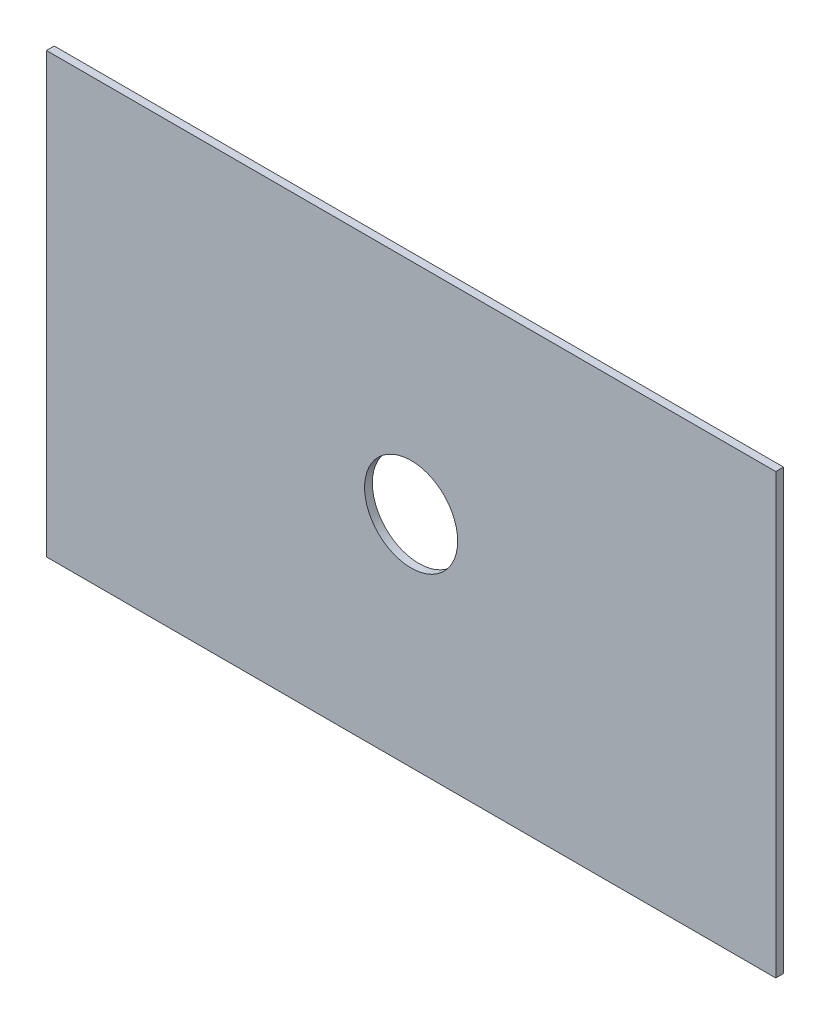
ISO-10303-21;
HEADER;
FILE_DESCRIPTION(('STEP AP214'),'2;1');
FILE_NAME('part.step','',(''),(''),'','','');
FILE_SCHEMA(('AUTOMOTIVE_DESIGN { 1 0 10303 214 1 1 1 1 }'));
ENDSEC;
DATA;
#1=APPLICATION_CONTEXT('core data for automotive mechanical design processes');
#2=APPLICATION_PROTOCOL_DEFINITION('international standard','automotive_design',2000,#1);
#3=PRODUCT_CONTEXT('',#1,'mechanical');
#4=PRODUCT('Part','Part','',(#3));
#5=PRODUCT_RELATED_PRODUCT_CATEGORY('part','',(#4));
#6=PRODUCT_DEFINITION_FORMATION('','',#4);
#7=PRODUCT_DEFINITION_CONTEXT('part definition',#1,'design');
#8=PRODUCT_DEFINITION('design','',#6,#7);
#9=PRODUCT_DEFINITION_SHAPE('','',#8);
#10=(LENGTH_UNIT() NAMED_UNIT(*) SI_UNIT(.MILLI.,.METRE.));
#11=(NAMED_UNIT(*) PLANE_ANGLE_UNIT() SI_UNIT($,.RADIAN.));
#12=(NAMED_UNIT(*) SI_UNIT($,.STERADIAN.) SOLID_ANGLE_UNIT());
#13=UNCERTAINTY_MEASURE_WITH_UNIT(LENGTH_MEASURE(1.E-05),#10,'distance_accuracy_value','');
#14=(GEOMETRIC_REPRESENTATION_CONTEXT(3) GLOBAL_UNCERTAINTY_ASSIGNED_CONTEXT((#13)) GLOBAL_UNIT_ASSIGNED_CONTEXT((#10,
#11,#12)) REPRESENTATION_CONTEXT('',''));
#15=CARTESIAN_POINT('',(0.,0.,0.));
#16=DIRECTION('',(0.,0.,1.));
#17=DIRECTION('',(1.,0.,0.));
#18=AXIS2_PLACEMENT_3D('',#15,#16,#17);
#19=CARTESIAN_POINT('',(23.5001496169545,-14.1332099633575,0.5));
#20=DIRECTION('',(-1.,0.,0.));
#21=DIRECTION('',(0.,0.,1.));
#22=AXIS2_PLACEMENT_3D('',#19,#20,#21);
#23=PLANE('',#22);
#24=DIRECTION('',(0.,1.,0.));
#25=VECTOR('',#24,1.);
#26=CARTESIAN_POINT('',(23.5001496169545,-14.1332099633575,0.));
#27=LINE('',#26,#25);
#28=CARTESIAN_POINT('',(23.5001496169545,-14.1332099633575,0.));
#29=VERTEX_POINT('',#28);
#30=CARTESIAN_POINT('',(23.5001496169545,14.1332099633575,0.));
#31=VERTEX_POINT('',#30);
#32=EDGE_CURVE('E99',#29,#31,#27,.T.);
#33=ORIENTED_EDGE('',*,*,#32,.T.);
#34=DIRECTION('',(0.,0.,-1.));
#35=VECTOR('',#34,1.);
#36=CARTESIAN_POINT('',(23.5001496169545,14.1332099633575,0.5));
#37=LINE('',#36,#35);
#38=CARTESIAN_POINT('',(23.5001496169545,14.1332099633575,0.5));
#39=VERTEX_POINT('',#38);
#40=EDGE_CURVE('E11',#39,#31,#37,.T.);
#41=ORIENTED_EDGE('',*,*,#40,.F.);
#42=DIRECTION('',(0.,1.,0.));
#43=VECTOR('',#42,1.);
#44=CARTESIAN_POINT('',(23.5001496169545,-14.1332099633575,0.5));
#45=LINE('',#44,#43);
#46=CARTESIAN_POINT('',(23.5001496169545,-14.1332099633575,0.5));
#47=VERTEX_POINT('',#46);
#48=EDGE_CURVE('E86',#47,#39,#45,.T.);
#49=ORIENTED_EDGE('',*,*,#48,.F.);
#50=DIRECTION('',(0.,0.,-1.));
#51=VECTOR('',#50,1.);
#52=CARTESIAN_POINT('',(23.5001496169545,-14.1332099633575,0.5));
#53=LINE('',#52,#51);
#54=EDGE_CURVE('E95',#47,#29,#53,.T.);
#55=ORIENTED_EDGE('',*,*,#54,.T.);
#56=EDGE_LOOP('',(#33,#41,#49,#55));
#57=FACE_BOUND('',#56,.T.);
#58=ADVANCED_FACE('F34',(#57),#23,.F.);
#59=CARTESIAN_POINT('',(-23.5001496169545,14.1332099633575,0.5));
#60=DIRECTION('',(0.,-1.,0.));
#61=DIRECTION('',(0.,0.,-1.));
#62=AXIS2_PLACEMENT_3D('',#59,#60,#61);
#63=PLANE('',#62);
#64=DIRECTION('',(-1.,0.,0.));
#65=VECTOR('',#64,1.);
#66=CARTESIAN_POINT('',(-23.5001496169545,14.1332099633575,0.));
#67=LINE('',#66,#65);
#68=CARTESIAN_POINT('',(-23.5001496169545,14.1332099633575,0.));
#69=VERTEX_POINT('',#68);
#70=EDGE_CURVE('E90',#31,#69,#67,.T.);
#71=ORIENTED_EDGE('',*,*,#70,.T.);
#72=DIRECTION('',(0.,0.,-1.));
#73=VECTOR('',#72,1.);
#74=CARTESIAN_POINT('',(-23.5001496169545,14.1332099633575,0.5));
#75=LINE('',#74,#73);
#76=CARTESIAN_POINT('',(-23.5001496169545,14.1332099633575,0.5));
#77=VERTEX_POINT('',#76);
#78=EDGE_CURVE('E43',#77,#69,#75,.T.);
#79=ORIENTED_EDGE('',*,*,#78,.F.);
#80=DIRECTION('',(-1.,0.,0.));
#81=VECTOR('',#80,1.);
#82=CARTESIAN_POINT('',(-23.5001496169545,14.1332099633575,0.5));
#83=LINE('',#82,#81);
#84=EDGE_CURVE('E81',#39,#77,#83,.T.);
#85=ORIENTED_EDGE('',*,*,#84,.F.);
#86=ORIENTED_EDGE('',*,*,#40,.T.);
#87=EDGE_LOOP('',(#71,#79,#85,#86));
#88=FACE_BOUND('',#87,.T.);
#89=ADVANCED_FACE('F89',(#88),#63,.F.);
#90=CARTESIAN_POINT('',(-23.5001496169545,-14.1332099633575,0.5));
#91=DIRECTION('',(1.,0.,0.));
#92=DIRECTION('',(0.,0.,-1.));
#93=AXIS2_PLACEMENT_3D('',#90,#91,#92);
#94=PLANE('',#93);
#95=DIRECTION('',(0.,-1.,0.));
#96=VECTOR('',#95,1.);
#97=CARTESIAN_POINT('',(-23.5001496169545,-14.1332099633575,0.));
#98=LINE('',#97,#96);
#99=CARTESIAN_POINT('',(-23.5001496169545,-14.1332099633575,0.));
#100=VERTEX_POINT('',#99);
#101=EDGE_CURVE('E68',#69,#100,#98,.T.);
#102=ORIENTED_EDGE('',*,*,#101,.T.);
#103=DIRECTION('',(0.,0.,-1.));
#104=VECTOR('',#103,1.);
#105=CARTESIAN_POINT('',(-23.5001496169545,-14.1332099633575,0.5));
#106=LINE('',#105,#104);
#107=CARTESIAN_POINT('',(-23.5001496169545,-14.1332099633575,0.5));
#108=VERTEX_POINT('',#107);
#109=EDGE_CURVE('E91',#108,#100,#106,.T.);
#110=ORIENTED_EDGE('',*,*,#109,.F.);
#111=DIRECTION('',(0.,-1.,0.));
#112=VECTOR('',#111,1.);
#113=CARTESIAN_POINT('',(-23.5001496169545,-14.1332099633575,0.5));
#114=LINE('',#113,#112);
#115=EDGE_CURVE('E84',#77,#108,#114,.T.);
#116=ORIENTED_EDGE('',*,*,#115,.F.);
#117=ORIENTED_EDGE('',*,*,#78,.T.);
#118=EDGE_LOOP('',(#102,#110,#116,#117));
#119=FACE_BOUND('',#118,.T.);
#120=ADVANCED_FACE('F93',(#119),#94,.F.);
#121=CARTESIAN_POINT('',(-23.5001496169545,-14.1332099633575,0.5));
#122=DIRECTION('',(0.,1.,0.));
#123=DIRECTION('',(0.,0.,1.));
#124=AXIS2_PLACEMENT_3D('',#121,#122,#123);
#125=PLANE('',#124);
#126=DIRECTION('',(1.,0.,0.));
#127=VECTOR('',#126,1.);
#128=CARTESIAN_POINT('',(-23.5001496169545,-14.1332099633575,0.));
#129=LINE('',#128,#127);
#130=EDGE_CURVE('E74',#100,#29,#129,.T.);
#131=ORIENTED_EDGE('',*,*,#130,.T.);
#132=ORIENTED_EDGE('',*,*,#54,.F.);
#133=DIRECTION('',(1.,0.,0.));
#134=VECTOR('',#133,1.);
#135=CARTESIAN_POINT('',(-23.5001496169545,-14.1332099633575,0.5));
#136=LINE('',#135,#134);
#137=EDGE_CURVE('E51',#108,#47,#136,.T.);
#138=ORIENTED_EDGE('',*,*,#137,.F.);
#139=ORIENTED_EDGE('',*,*,#109,.T.);
#140=EDGE_LOOP('',(#131,#132,#138,#139));
#141=FACE_BOUND('',#140,.T.);
#142=ADVANCED_FACE('F106',(#141),#125,.F.);
#143=CARTESIAN_POINT('',(0.,0.,0.5));
#144=DIRECTION('',(0.,0.,-1.));
#145=DIRECTION('',(-1.,0.,0.));
#146=AXIS2_PLACEMENT_3D('',#143,#144,#145);
#147=PLANE('',#146);
#148=CARTESIAN_POINT('',(0.,0.,0.5));
#149=DIRECTION('',(0.,0.,1.));
#150=DIRECTION('',(1.,0.,0.));
#151=AXIS2_PLACEMENT_3D('',#148,#149,#150);
#152=CIRCLE('',#151,3.);
#153=CARTESIAN_POINT('',(3.,0.,0.5));
#154=VERTEX_POINT('',#153);
#155=EDGE_CURVE('E112',#154,#154,#152,.T.);
#156=ORIENTED_EDGE('',*,*,#155,.F.);
#157=EDGE_LOOP('',(#156));
#158=FACE_BOUND('',#157,.T.);
#159=ORIENTED_EDGE('',*,*,#48,.T.);
#160=ORIENTED_EDGE('',*,*,#84,.T.);
#161=ORIENTED_EDGE('',*,*,#115,.T.);
#162=ORIENTED_EDGE('',*,*,#137,.T.);
#163=EDGE_LOOP('',(#159,#160,#161,#162));
#164=FACE_BOUND('',#163,.T.);
#165=ADVANCED_FACE('F82',(#158,#164),#147,.F.);
#166=CARTESIAN_POINT('',(0.,0.,0.));
#167=DIRECTION('',(0.,0.,-1.));
#168=DIRECTION('',(-1.,0.,0.));
#169=AXIS2_PLACEMENT_3D('',#166,#167,#168);
#170=PLANE('',#169);
#171=CARTESIAN_POINT('',(0.,0.,0.));
#172=DIRECTION('',(0.,0.,-1.));
#173=DIRECTION('',(-1.,0.,0.));
#174=AXIS2_PLACEMENT_3D('',#171,#172,#173);
#175=CIRCLE('',#174,3.);
#176=CARTESIAN_POINT('',(-3.,0.,0.));
#177=VERTEX_POINT('',#176);
#178=EDGE_CURVE('E37',#177,#177,#175,.T.);
#179=ORIENTED_EDGE('',*,*,#178,.F.);
#180=EDGE_LOOP('',(#179));
#181=FACE_BOUND('',#180,.T.);
#182=ORIENTED_EDGE('',*,*,#32,.F.);
#183=ORIENTED_EDGE('',*,*,#130,.F.);
#184=ORIENTED_EDGE('',*,*,#101,.F.);
#185=ORIENTED_EDGE('',*,*,#70,.F.);
#186=EDGE_LOOP('',(#182,#183,#184,#185));
#187=FACE_BOUND('',#186,.T.);
#188=ADVANCED_FACE('F109',(#181,#187),#170,.T.);
#189=CARTESIAN_POINT('',(0.,0.,-0.5));
#190=DIRECTION('',(0.,0.,1.));
#191=DIRECTION('',(1.,0.,0.));
#192=AXIS2_PLACEMENT_3D('',#189,#190,#191);
#193=CYLINDRICAL_SURFACE('',#192,3.);
#194=ORIENTED_EDGE('',*,*,#178,.T.);
#195=EDGE_LOOP('',(#194));
#196=FACE_BOUND('',#195,.T.);
#197=ORIENTED_EDGE('',*,*,#155,.T.);
#198=EDGE_LOOP('',(#197));
#199=FACE_BOUND('',#198,.T.);
#200=ADVANCED_FACE('F119',(#196,#199),#193,.F.);
#201=CLOSED_SHELL('',(#58,#89,#120,#142,#165,#188,#200));
#202=MANIFOLD_SOLID_BREP('B2',#201);
#203=ADVANCED_BREP_SHAPE_REPRESENTATION('',(#18,#202),#14);
#204=SHAPE_DEFINITION_REPRESENTATION(#9,#203);
ENDSEC;
END-ISO-10303-21;
